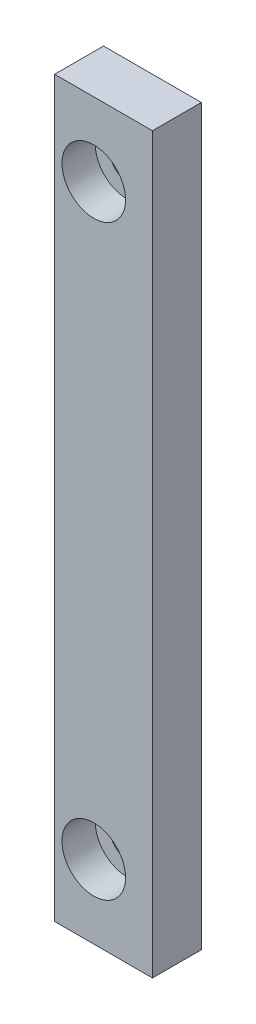
ISO-10303-21;
HEADER;
FILE_DESCRIPTION(('STEP AP214'),'2;1');
FILE_NAME('part.step','',(''),(''),'','','');
FILE_SCHEMA(('AUTOMOTIVE_DESIGN { 1 0 10303 214 1 1 1 1 }'));
ENDSEC;
DATA;
#1=APPLICATION_CONTEXT('core data for automotive mechanical design processes');
#2=APPLICATION_PROTOCOL_DEFINITION('international standard','automotive_design',2000,#1);
#3=PRODUCT_CONTEXT('',#1,'mechanical');
#4=PRODUCT('Part','Part','',(#3));
#5=PRODUCT_RELATED_PRODUCT_CATEGORY('part','',(#4));
#6=PRODUCT_DEFINITION_FORMATION('','',#4);
#7=PRODUCT_DEFINITION_CONTEXT('part definition',#1,'design');
#8=PRODUCT_DEFINITION('design','',#6,#7);
#9=PRODUCT_DEFINITION_SHAPE('','',#8);
#10=(LENGTH_UNIT() NAMED_UNIT(*) SI_UNIT(.MILLI.,.METRE.));
#11=(NAMED_UNIT(*) PLANE_ANGLE_UNIT() SI_UNIT($,.RADIAN.));
#12=(NAMED_UNIT(*) SI_UNIT($,.STERADIAN.) SOLID_ANGLE_UNIT());
#13=UNCERTAINTY_MEASURE_WITH_UNIT(LENGTH_MEASURE(1.E-05),#10,'distance_accuracy_value','');
#14=(GEOMETRIC_REPRESENTATION_CONTEXT(3) GLOBAL_UNCERTAINTY_ASSIGNED_CONTEXT((#13)) GLOBAL_UNIT_ASSIGNED_CONTEXT((#10,
#11,#12)) REPRESENTATION_CONTEXT('',''));
#15=CARTESIAN_POINT('',(0.,0.,0.));
#16=DIRECTION('',(0.,0.,1.));
#17=DIRECTION('',(1.,0.,0.));
#18=AXIS2_PLACEMENT_3D('',#15,#16,#17);
#19=CARTESIAN_POINT('',(0.,0.,5.));
#20=DIRECTION('',(1.,0.,0.));
#21=DIRECTION('',(0.,0.,-1.));
#22=AXIS2_PLACEMENT_3D('',#19,#20,#21);
#23=PLANE('',#22);
#24=DIRECTION('',(0.,-1.,0.));
#25=VECTOR('',#24,1.);
#26=CARTESIAN_POINT('',(0.,0.,0.));
#27=LINE('',#26,#25);
#28=CARTESIAN_POINT('',(0.,75.,0.));
#29=VERTEX_POINT('',#28);
#30=CARTESIAN_POINT('',(0.,0.,0.));
#31=VERTEX_POINT('',#30);
#32=EDGE_CURVE('E101',#29,#31,#27,.T.);
#33=ORIENTED_EDGE('',*,*,#32,.T.);
#34=DIRECTION('',(0.,0.,-1.));
#35=VECTOR('',#34,1.);
#36=CARTESIAN_POINT('',(0.,0.,5.));
#37=LINE('',#36,#35);
#38=CARTESIAN_POINT('',(0.,0.,5.));
#39=VERTEX_POINT('',#38);
#40=EDGE_CURVE('E11',#39,#31,#37,.T.);
#41=ORIENTED_EDGE('',*,*,#40,.F.);
#42=DIRECTION('',(0.,-1.,0.));
#43=VECTOR('',#42,1.);
#44=CARTESIAN_POINT('',(0.,0.,5.));
#45=LINE('',#44,#43);
#46=CARTESIAN_POINT('',(0.,75.,5.));
#47=VERTEX_POINT('',#46);
#48=EDGE_CURVE('E88',#47,#39,#45,.T.);
#49=ORIENTED_EDGE('',*,*,#48,.F.);
#50=DIRECTION('',(0.,0.,-1.));
#51=VECTOR('',#50,1.);
#52=CARTESIAN_POINT('',(0.,75.,5.));
#53=LINE('',#52,#51);
#54=EDGE_CURVE('E97',#47,#29,#53,.T.);
#55=ORIENTED_EDGE('',*,*,#54,.T.);
#56=EDGE_LOOP('',(#33,#41,#49,#55));
#57=FACE_BOUND('',#56,.T.);
#58=ADVANCED_FACE('F35',(#57),#23,.F.);
#59=CARTESIAN_POINT('',(0.,0.,5.));
#60=DIRECTION('',(0.,1.,0.));
#61=DIRECTION('',(0.,0.,1.));
#62=AXIS2_PLACEMENT_3D('',#59,#60,#61);
#63=PLANE('',#62);
#64=DIRECTION('',(1.,0.,0.));
#65=VECTOR('',#64,1.);
#66=CARTESIAN_POINT('',(0.,0.,0.));
#67=LINE('',#66,#65);
#68=CARTESIAN_POINT('',(10.,0.,0.));
#69=VERTEX_POINT('',#68);
#70=EDGE_CURVE('E92',#31,#69,#67,.T.);
#71=ORIENTED_EDGE('',*,*,#70,.T.);
#72=DIRECTION('',(0.,0.,-1.));
#73=VECTOR('',#72,1.);
#74=CARTESIAN_POINT('',(10.,0.,5.));
#75=LINE('',#74,#73);
#76=CARTESIAN_POINT('',(10.,0.,5.));
#77=VERTEX_POINT('',#76);
#78=EDGE_CURVE('E44',#77,#69,#75,.T.);
#79=ORIENTED_EDGE('',*,*,#78,.F.);
#80=DIRECTION('',(1.,0.,0.));
#81=VECTOR('',#80,1.);
#82=CARTESIAN_POINT('',(0.,0.,5.));
#83=LINE('',#82,#81);
#84=EDGE_CURVE('E83',#39,#77,#83,.T.);
#85=ORIENTED_EDGE('',*,*,#84,.F.);
#86=ORIENTED_EDGE('',*,*,#40,.T.);
#87=EDGE_LOOP('',(#71,#79,#85,#86));
#88=FACE_BOUND('',#87,.T.);
#89=ADVANCED_FACE('F91',(#88),#63,.F.);
#90=CARTESIAN_POINT('',(10.,0.,5.));
#91=DIRECTION('',(-1.,0.,0.));
#92=DIRECTION('',(0.,-1.,0.));
#93=AXIS2_PLACEMENT_3D('',#90,#91,#92);
#94=PLANE('',#93);
#95=DIRECTION('',(0.,1.,0.));
#96=VECTOR('',#95,1.);
#97=CARTESIAN_POINT('',(10.,0.,0.));
#98=LINE('',#97,#96);
#99=CARTESIAN_POINT('',(9.99999999999999,75.,0.));
#100=VERTEX_POINT('',#99);
#101=EDGE_CURVE('E70',#69,#100,#98,.T.);
#102=ORIENTED_EDGE('',*,*,#101,.T.);
#103=DIRECTION('',(0.,0.,-1.));
#104=VECTOR('',#103,1.);
#105=CARTESIAN_POINT('',(9.99999999999999,75.,5.));
#106=LINE('',#105,#104);
#107=CARTESIAN_POINT('',(9.99999999999999,75.,5.));
#108=VERTEX_POINT('',#107);
#109=EDGE_CURVE('E93',#108,#100,#106,.T.);
#110=ORIENTED_EDGE('',*,*,#109,.F.);
#111=DIRECTION('',(0.,1.,0.));
#112=VECTOR('',#111,1.);
#113=CARTESIAN_POINT('',(10.,0.,5.));
#114=LINE('',#113,#112);
#115=EDGE_CURVE('E86',#77,#108,#114,.T.);
#116=ORIENTED_EDGE('',*,*,#115,.F.);
#117=ORIENTED_EDGE('',*,*,#78,.T.);
#118=EDGE_LOOP('',(#102,#110,#116,#117));
#119=FACE_BOUND('',#118,.T.);
#120=ADVANCED_FACE('F95',(#119),#94,.F.);
#121=CARTESIAN_POINT('',(0.,75.,5.));
#122=DIRECTION('',(0.,-1.,0.));
#123=DIRECTION('',(0.,0.,-1.));
#124=AXIS2_PLACEMENT_3D('',#121,#122,#123);
#125=PLANE('',#124);
#126=DIRECTION('',(-1.,0.,0.));
#127=VECTOR('',#126,1.);
#128=CARTESIAN_POINT('',(0.,75.,0.));
#129=LINE('',#128,#127);
#130=EDGE_CURVE('E76',#100,#29,#129,.T.);
#131=ORIENTED_EDGE('',*,*,#130,.T.);
#132=ORIENTED_EDGE('',*,*,#54,.F.);
#133=DIRECTION('',(-1.,0.,0.));
#134=VECTOR('',#133,1.);
#135=CARTESIAN_POINT('',(0.,75.,5.));
#136=LINE('',#135,#134);
#137=EDGE_CURVE('E53',#108,#47,#136,.T.);
#138=ORIENTED_EDGE('',*,*,#137,.F.);
#139=ORIENTED_EDGE('',*,*,#109,.T.);
#140=EDGE_LOOP('',(#131,#132,#138,#139));
#141=FACE_BOUND('',#140,.T.);
#142=ADVANCED_FACE('F139',(#141),#125,.F.);
#143=CARTESIAN_POINT('',(0.,0.,5.));
#144=DIRECTION('',(0.,0.,-1.));
#145=DIRECTION('',(-1.,0.,0.));
#146=AXIS2_PLACEMENT_3D('',#143,#144,#145);
#147=PLANE('',#146);
#148=CARTESIAN_POINT('',(4.,67.5,5.));
#149=DIRECTION('',(0.,0.,1.));
#150=DIRECTION('',(1.,0.,0.));
#151=AXIS2_PLACEMENT_3D('',#148,#149,#150);
#152=CIRCLE('',#151,3.25);
#153=CARTESIAN_POINT('',(7.25,67.5,5.));
#154=VERTEX_POINT('',#153);
#155=EDGE_CURVE('E130',#154,#154,#152,.T.);
#156=ORIENTED_EDGE('',*,*,#155,.F.);
#157=EDGE_LOOP('',(#156));
#158=FACE_BOUND('',#157,.T.);
#159=CARTESIAN_POINT('',(4.,7.49999999999999,5.));
#160=DIRECTION('',(0.,0.,1.));
#161=DIRECTION('',(1.,0.,0.));
#162=AXIS2_PLACEMENT_3D('',#159,#160,#161);
#163=CIRCLE('',#162,3.25);
#164=CARTESIAN_POINT('',(7.25,7.49999999999999,5.));
#165=VERTEX_POINT('',#164);
#166=EDGE_CURVE('E119',#165,#165,#163,.T.);
#167=ORIENTED_EDGE('',*,*,#166,.F.);
#168=EDGE_LOOP('',(#167));
#169=FACE_BOUND('',#168,.T.);
#170=ORIENTED_EDGE('',*,*,#48,.T.);
#171=ORIENTED_EDGE('',*,*,#84,.T.);
#172=ORIENTED_EDGE('',*,*,#115,.T.);
#173=ORIENTED_EDGE('',*,*,#137,.T.);
#174=EDGE_LOOP('',(#170,#171,#172,#173));
#175=FACE_BOUND('',#174,.T.);
#176=ADVANCED_FACE('F84',(#158,#169,#175),#147,.F.);
#177=CARTESIAN_POINT('',(0.,0.,0.));
#178=DIRECTION('',(0.,0.,-1.));
#179=DIRECTION('',(-1.,0.,0.));
#180=AXIS2_PLACEMENT_3D('',#177,#178,#179);
#181=PLANE('',#180);
#182=CARTESIAN_POINT('',(4.,67.5,0.));
#183=DIRECTION('',(0.,0.,-1.));
#184=DIRECTION('',(-1.,0.,0.));
#185=AXIS2_PLACEMENT_3D('',#182,#183,#184);
#186=CIRCLE('',#185,1.7);
#187=CARTESIAN_POINT('',(2.3,67.5,0.));
#188=VERTEX_POINT('',#187);
#189=EDGE_CURVE('E38',#188,#188,#186,.T.);
#190=ORIENTED_EDGE('',*,*,#189,.F.);
#191=EDGE_LOOP('',(#190));
#192=FACE_BOUND('',#191,.T.);
#193=CARTESIAN_POINT('',(4.,7.49999999999999,0.));
#194=DIRECTION('',(0.,0.,-1.));
#195=DIRECTION('',(-1.,0.,0.));
#196=AXIS2_PLACEMENT_3D('',#193,#194,#195);
#197=CIRCLE('',#196,1.7);
#198=CARTESIAN_POINT('',(2.3,7.49999999999999,0.));
#199=VERTEX_POINT('',#198);
#200=EDGE_CURVE('E104',#199,#199,#197,.T.);
#201=ORIENTED_EDGE('',*,*,#200,.F.);
#202=EDGE_LOOP('',(#201));
#203=FACE_BOUND('',#202,.T.);
#204=ORIENTED_EDGE('',*,*,#32,.F.);
#205=ORIENTED_EDGE('',*,*,#130,.F.);
#206=ORIENTED_EDGE('',*,*,#101,.F.);
#207=ORIENTED_EDGE('',*,*,#70,.F.);
#208=EDGE_LOOP('',(#204,#205,#206,#207));
#209=FACE_BOUND('',#208,.T.);
#210=ADVANCED_FACE('F138',(#192,#203,#209),#181,.T.);
#211=CARTESIAN_POINT('',(4.,7.49999999999999,5.));
#212=DIRECTION('',(0.,0.,1.));
#213=DIRECTION('',(1.,0.,0.));
#214=AXIS2_PLACEMENT_3D('',#211,#212,#213);
#215=CYLINDRICAL_SURFACE('',#214,1.7);
#216=ORIENTED_EDGE('',*,*,#200,.T.);
#217=EDGE_LOOP('',(#216));
#218=FACE_BOUND('',#217,.T.);
#219=CARTESIAN_POINT('',(4.,7.49999999999999,1.6));
#220=DIRECTION('',(0.,0.,1.));
#221=DIRECTION('',(1.,0.,0.));
#222=AXIS2_PLACEMENT_3D('',#219,#220,#221);
#223=CIRCLE('',#222,1.7);
#224=CARTESIAN_POINT('',(5.7,7.49999999999999,1.6));
#225=VERTEX_POINT('',#224);
#226=EDGE_CURVE('E110',#225,#225,#223,.T.);
#227=ORIENTED_EDGE('',*,*,#226,.T.);
#228=EDGE_LOOP('',(#227));
#229=FACE_BOUND('',#228,.T.);
#230=ADVANCED_FACE('F156',(#218,#229),#215,.F.);
#231=CARTESIAN_POINT('',(5.7,7.49999999999999,1.6));
#232=DIRECTION('',(0.,0.,-1.));
#233=DIRECTION('',(-1.,0.,0.));
#234=AXIS2_PLACEMENT_3D('',#231,#232,#233);
#235=PLANE('',#234);
#236=ORIENTED_EDGE('',*,*,#226,.F.);
#237=EDGE_LOOP('',(#236));
#238=FACE_BOUND('',#237,.T.);
#239=CARTESIAN_POINT('',(4.,7.49999999999999,1.6));
#240=DIRECTION('',(0.,0.,1.));
#241=DIRECTION('',(1.,0.,0.));
#242=AXIS2_PLACEMENT_3D('',#239,#240,#241);
#243=CIRCLE('',#242,3.25);
#244=CARTESIAN_POINT('',(7.25,7.49999999999999,1.6));
#245=VERTEX_POINT('',#244);
#246=EDGE_CURVE('E114',#245,#245,#243,.T.);
#247=ORIENTED_EDGE('',*,*,#246,.T.);
#248=EDGE_LOOP('',(#247));
#249=FACE_BOUND('',#248,.T.);
#250=ADVANCED_FACE('F146',(#238,#249),#235,.F.);
#251=CARTESIAN_POINT('',(4.,7.49999999999999,5.));
#252=DIRECTION('',(0.,0.,1.));
#253=DIRECTION('',(1.,0.,0.));
#254=AXIS2_PLACEMENT_3D('',#251,#252,#253);
#255=CYLINDRICAL_SURFACE('',#254,3.25);
#256=ORIENTED_EDGE('',*,*,#246,.F.);
#257=EDGE_LOOP('',(#256));
#258=FACE_BOUND('',#257,.T.);
#259=ORIENTED_EDGE('',*,*,#166,.T.);
#260=EDGE_LOOP('',(#259));
#261=FACE_BOUND('',#260,.T.);
#262=ADVANCED_FACE('F143',(#258,#261),#255,.F.);
#263=CARTESIAN_POINT('',(4.,67.5,5.));
#264=DIRECTION('',(0.,0.,1.));
#265=DIRECTION('',(1.,0.,0.));
#266=AXIS2_PLACEMENT_3D('',#263,#264,#265);
#267=CYLINDRICAL_SURFACE('',#266,1.7);
#268=ORIENTED_EDGE('',*,*,#189,.T.);
#269=EDGE_LOOP('',(#268));
#270=FACE_BOUND('',#269,.T.);
#271=CARTESIAN_POINT('',(4.,67.5,1.6));
#272=DIRECTION('',(0.,0.,1.));
#273=DIRECTION('',(1.,0.,0.));
#274=AXIS2_PLACEMENT_3D('',#271,#272,#273);
#275=CIRCLE('',#274,1.7);
#276=CARTESIAN_POINT('',(5.7,67.5,1.6));
#277=VERTEX_POINT('',#276);
#278=EDGE_CURVE('E124',#277,#277,#275,.T.);
#279=ORIENTED_EDGE('',*,*,#278,.T.);
#280=EDGE_LOOP('',(#279));
#281=FACE_BOUND('',#280,.T.);
#282=ADVANCED_FACE('F145',(#270,#281),#267,.F.);
#283=CARTESIAN_POINT('',(5.7,67.5,1.6));
#284=DIRECTION('',(0.,0.,-1.));
#285=DIRECTION('',(-1.,0.,0.));
#286=AXIS2_PLACEMENT_3D('',#283,#284,#285);
#287=PLANE('',#286);
#288=ORIENTED_EDGE('',*,*,#278,.F.);
#289=EDGE_LOOP('',(#288));
#290=FACE_BOUND('',#289,.T.);
#291=CARTESIAN_POINT('',(4.,67.5,1.6));
#292=DIRECTION('',(0.,0.,1.));
#293=DIRECTION('',(1.,0.,0.));
#294=AXIS2_PLACEMENT_3D('',#291,#292,#293);
#295=CIRCLE('',#294,3.25);
#296=CARTESIAN_POINT('',(7.25,67.5,1.6));
#297=VERTEX_POINT('',#296);
#298=EDGE_CURVE('E127',#297,#297,#295,.T.);
#299=ORIENTED_EDGE('',*,*,#298,.T.);
#300=EDGE_LOOP('',(#299));
#301=FACE_BOUND('',#300,.T.);
#302=ADVANCED_FACE('F153',(#290,#301),#287,.F.);
#303=CARTESIAN_POINT('',(4.,67.5,5.));
#304=DIRECTION('',(0.,0.,1.));
#305=DIRECTION('',(1.,0.,0.));
#306=AXIS2_PLACEMENT_3D('',#303,#304,#305);
#307=CYLINDRICAL_SURFACE('',#306,3.25);
#308=ORIENTED_EDGE('',*,*,#298,.F.);
#309=EDGE_LOOP('',(#308));
#310=FACE_BOUND('',#309,.T.);
#311=ORIENTED_EDGE('',*,*,#155,.T.);
#312=EDGE_LOOP('',(#311));
#313=FACE_BOUND('',#312,.T.);
#314=ADVANCED_FACE('F134',(#310,#313),#307,.F.);
#315=CLOSED_SHELL('',(#58,#89,#120,#142,#176,#210,#230,#250,#262,#282,#302,#314));
#316=MANIFOLD_SOLID_BREP('B2',#315);
#317=ADVANCED_BREP_SHAPE_REPRESENTATION('',(#18,#316),#14);
#318=SHAPE_DEFINITION_REPRESENTATION(#9,#317);
ENDSEC;
END-ISO-10303-21;
